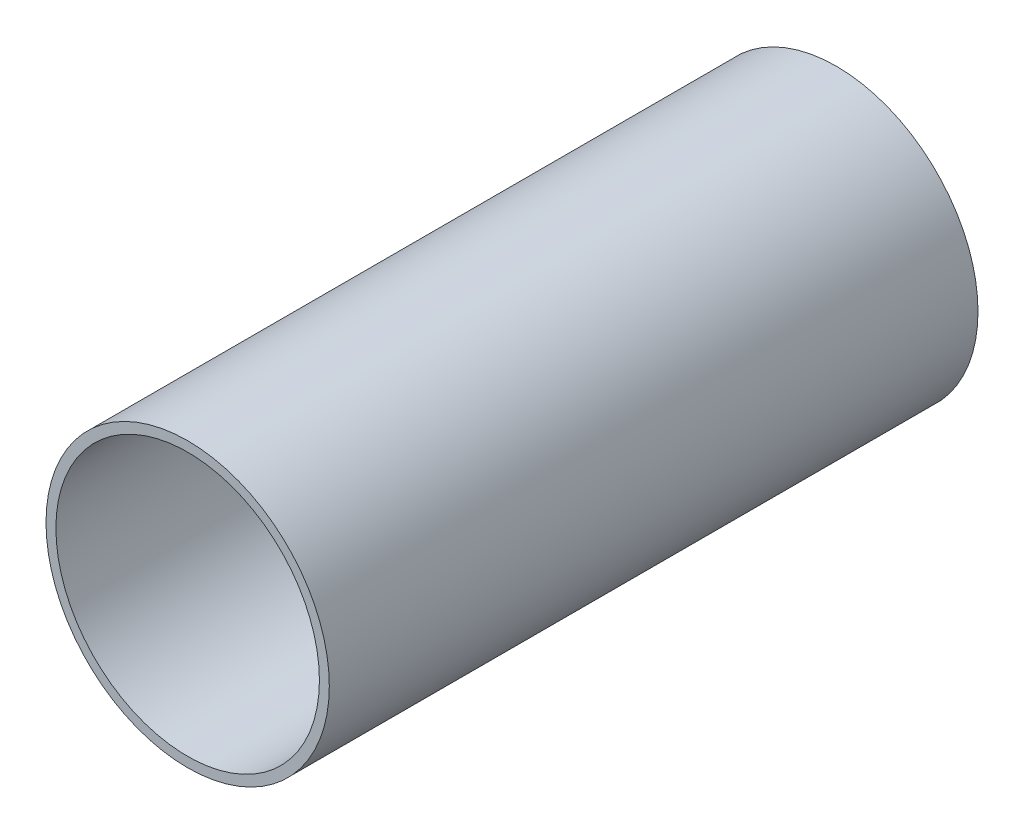
ISO-10303-21;
HEADER;
FILE_DESCRIPTION(('STEP AP214'),'2;1');
FILE_NAME('part.step','',(''),(''),'','','');
FILE_SCHEMA(('AUTOMOTIVE_DESIGN { 1 0 10303 214 1 1 1 1 }'));
ENDSEC;
DATA;
#1=APPLICATION_CONTEXT('core data for automotive mechanical design processes');
#2=APPLICATION_PROTOCOL_DEFINITION('international standard','automotive_design',2000,#1);
#3=PRODUCT_CONTEXT('',#1,'mechanical');
#4=PRODUCT('Part','Part','',(#3));
#5=PRODUCT_RELATED_PRODUCT_CATEGORY('part','',(#4));
#6=PRODUCT_DEFINITION_FORMATION('','',#4);
#7=PRODUCT_DEFINITION_CONTEXT('part definition',#1,'design');
#8=PRODUCT_DEFINITION('design','',#6,#7);
#9=PRODUCT_DEFINITION_SHAPE('','',#8);
#10=(LENGTH_UNIT() NAMED_UNIT(*) SI_UNIT(.MILLI.,.METRE.));
#11=(NAMED_UNIT(*) PLANE_ANGLE_UNIT() SI_UNIT($,.RADIAN.));
#12=(NAMED_UNIT(*) SI_UNIT($,.STERADIAN.) SOLID_ANGLE_UNIT());
#13=UNCERTAINTY_MEASURE_WITH_UNIT(LENGTH_MEASURE(1.E-05),#10,'distance_accuracy_value','');
#14=(GEOMETRIC_REPRESENTATION_CONTEXT(3) GLOBAL_UNCERTAINTY_ASSIGNED_CONTEXT((#13)) GLOBAL_UNIT_ASSIGNED_CONTEXT((#10,
#11,#12)) REPRESENTATION_CONTEXT('',''));
#15=CARTESIAN_POINT('',(0.,0.,0.));
#16=DIRECTION('',(0.,0.,1.));
#17=DIRECTION('',(1.,0.,0.));
#18=AXIS2_PLACEMENT_3D('',#15,#16,#17);
#19=CARTESIAN_POINT('',(0.,0.,101.6));
#20=DIRECTION('',(0.,0.,1.));
#21=DIRECTION('',(1.,0.,0.));
#22=AXIS2_PLACEMENT_3D('',#19,#20,#21);
#23=PLANE('',#22);
#24=CARTESIAN_POINT('',(0.,0.,101.6));
#25=DIRECTION('',(0.,0.,1.));
#26=DIRECTION('',(1.,0.,0.));
#27=AXIS2_PLACEMENT_3D('',#24,#25,#26);
#28=CIRCLE('',#27,22.1869);
#29=CARTESIAN_POINT('',(22.1869,0.,101.6));
#30=VERTEX_POINT('',#29);
#31=EDGE_CURVE('E10',#30,#30,#28,.T.);
#32=ORIENTED_EDGE('',*,*,#31,.T.);
#33=EDGE_LOOP('',(#32));
#34=FACE_BOUND('',#33,.T.);
#35=CARTESIAN_POINT('',(0.,0.,101.6));
#36=DIRECTION('',(0.,0.,1.));
#37=DIRECTION('',(1.,0.,0.));
#38=AXIS2_PLACEMENT_3D('',#35,#36,#37);
#39=CIRCLE('',#38,20.6375);
#40=CARTESIAN_POINT('',(20.6375,0.,101.6));
#41=VERTEX_POINT('',#40);
#42=EDGE_CURVE('E42',#41,#41,#39,.T.);
#43=ORIENTED_EDGE('',*,*,#42,.F.);
#44=EDGE_LOOP('',(#43));
#45=FACE_BOUND('',#44,.T.);
#46=ADVANCED_FACE('F31',(#34,#45),#23,.T.);
#47=CARTESIAN_POINT('',(0.,0.,0.));
#48=DIRECTION('',(0.,0.,1.));
#49=DIRECTION('',(1.,0.,0.));
#50=AXIS2_PLACEMENT_3D('',#47,#48,#49);
#51=PLANE('',#50);
#52=CARTESIAN_POINT('',(0.,0.,0.));
#53=DIRECTION('',(0.,0.,1.));
#54=DIRECTION('',(1.,0.,0.));
#55=AXIS2_PLACEMENT_3D('',#52,#53,#54);
#56=CIRCLE('',#55,22.1869);
#57=CARTESIAN_POINT('',(22.1869,0.,0.));
#58=VERTEX_POINT('',#57);
#59=EDGE_CURVE('E35',#58,#58,#56,.T.);
#60=ORIENTED_EDGE('',*,*,#59,.F.);
#61=EDGE_LOOP('',(#60));
#62=FACE_BOUND('',#61,.T.);
#63=CARTESIAN_POINT('',(0.,0.,0.));
#64=DIRECTION('',(0.,0.,1.));
#65=DIRECTION('',(1.,0.,0.));
#66=AXIS2_PLACEMENT_3D('',#63,#64,#65);
#67=CIRCLE('',#66,20.6375);
#68=CARTESIAN_POINT('',(20.6375,0.,0.));
#69=VERTEX_POINT('',#68);
#70=EDGE_CURVE('E44',#69,#69,#67,.T.);
#71=ORIENTED_EDGE('',*,*,#70,.T.);
#72=EDGE_LOOP('',(#71));
#73=FACE_BOUND('',#72,.T.);
#74=ADVANCED_FACE('F54',(#62,#73),#51,.F.);
#75=CARTESIAN_POINT('',(0.,0.,101.6));
#76=DIRECTION('',(0.,0.,-1.));
#77=DIRECTION('',(-1.,0.,0.));
#78=AXIS2_PLACEMENT_3D('',#75,#76,#77);
#79=CYLINDRICAL_SURFACE('',#78,22.1869);
#80=ORIENTED_EDGE('',*,*,#31,.F.);
#81=EDGE_LOOP('',(#80));
#82=FACE_BOUND('',#81,.T.);
#83=ORIENTED_EDGE('',*,*,#59,.T.);
#84=EDGE_LOOP('',(#83));
#85=FACE_BOUND('',#84,.T.);
#86=ADVANCED_FACE('F33',(#82,#85),#79,.T.);
#87=CARTESIAN_POINT('',(0.,0.,101.6));
#88=DIRECTION('',(0.,0.,-1.));
#89=DIRECTION('',(-1.,0.,0.));
#90=AXIS2_PLACEMENT_3D('',#87,#88,#89);
#91=CYLINDRICAL_SURFACE('',#90,20.6375);
#92=ORIENTED_EDGE('',*,*,#42,.T.);
#93=EDGE_LOOP('',(#92));
#94=FACE_BOUND('',#93,.T.);
#95=ORIENTED_EDGE('',*,*,#70,.F.);
#96=EDGE_LOOP('',(#95));
#97=FACE_BOUND('',#96,.T.);
#98=ADVANCED_FACE('F50',(#94,#97),#91,.F.);
#99=CLOSED_SHELL('',(#46,#74,#86,#98));
#100=MANIFOLD_SOLID_BREP('B2',#99);
#101=ADVANCED_BREP_SHAPE_REPRESENTATION('',(#18,#100),#14);
#102=SHAPE_DEFINITION_REPRESENTATION(#9,#101);
ENDSEC;
END-ISO-10303-21;
